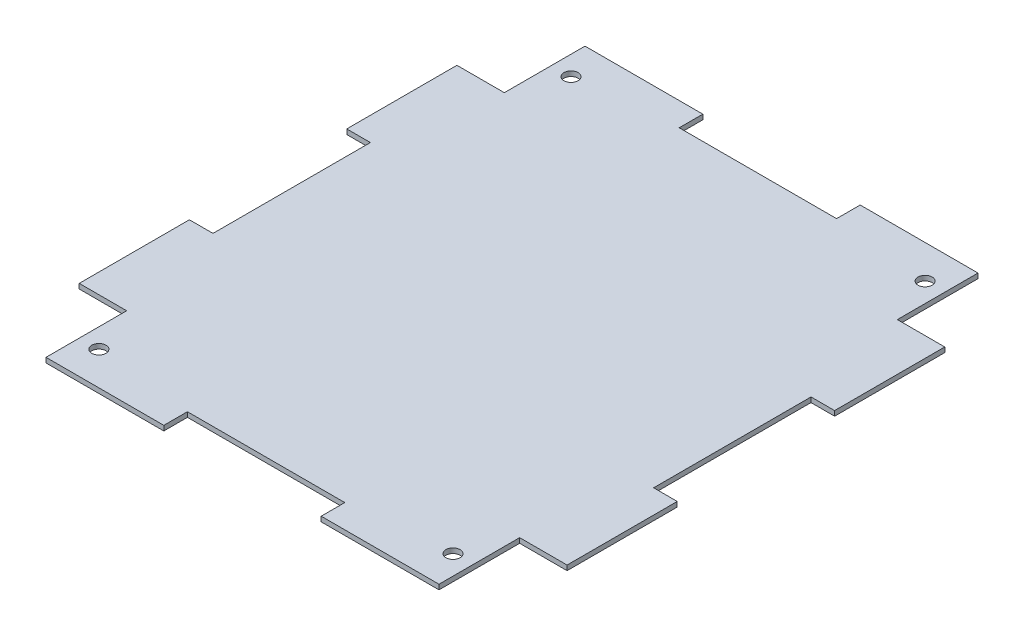
ISO-10303-21;
HEADER;
FILE_DESCRIPTION(('STEP AP214'),'2;1');
FILE_NAME('part.step','',(''),(''),'','','');
FILE_SCHEMA(('AUTOMOTIVE_DESIGN { 1 0 10303 214 1 1 1 1 }'));
ENDSEC;
DATA;
#1=APPLICATION_CONTEXT('core data for automotive mechanical design processes');
#2=APPLICATION_PROTOCOL_DEFINITION('international standard','automotive_design',2000,#1);
#3=PRODUCT_CONTEXT('',#1,'mechanical');
#4=PRODUCT('Part','Part','',(#3));
#5=PRODUCT_RELATED_PRODUCT_CATEGORY('part','',(#4));
#6=PRODUCT_DEFINITION_FORMATION('','',#4);
#7=PRODUCT_DEFINITION_CONTEXT('part definition',#1,'design');
#8=PRODUCT_DEFINITION('design','',#6,#7);
#9=PRODUCT_DEFINITION_SHAPE('','',#8);
#10=(LENGTH_UNIT() NAMED_UNIT(*) SI_UNIT(.MILLI.,.METRE.));
#11=(NAMED_UNIT(*) PLANE_ANGLE_UNIT() SI_UNIT($,.RADIAN.));
#12=(NAMED_UNIT(*) SI_UNIT($,.STERADIAN.) SOLID_ANGLE_UNIT());
#13=UNCERTAINTY_MEASURE_WITH_UNIT(LENGTH_MEASURE(1.E-05),#10,'distance_accuracy_value','');
#14=(GEOMETRIC_REPRESENTATION_CONTEXT(3) GLOBAL_UNCERTAINTY_ASSIGNED_CONTEXT((#13)) GLOBAL_UNIT_ASSIGNED_CONTEXT((#10,
#11,#12)) REPRESENTATION_CONTEXT('',''));
#15=CARTESIAN_POINT('',(0.,0.,0.));
#16=DIRECTION('',(0.,0.,1.));
#17=DIRECTION('',(1.,0.,0.));
#18=AXIS2_PLACEMENT_3D('',#15,#16,#17);
#19=CARTESIAN_POINT('',(0.,1.5875,0.));
#20=DIRECTION('',(0.,1.,0.));
#21=DIRECTION('',(0.,0.,1.));
#22=AXIS2_PLACEMENT_3D('',#19,#20,#21);
#23=PLANE('',#22);
#24=CARTESIAN_POINT('',(57.15,1.5875,76.2));
#25=DIRECTION('',(0.,1.,0.));
#26=DIRECTION('',(0.,0.,1.));
#27=AXIS2_PLACEMENT_3D('',#24,#25,#26);
#28=CIRCLE('',#27,2.28599999999999);
#29=CARTESIAN_POINT('',(57.15,1.5875,78.486));
#30=VERTEX_POINT('',#29);
#31=EDGE_CURVE('E588',#30,#30,#28,.T.);
#32=ORIENTED_EDGE('',*,*,#31,.F.);
#33=EDGE_LOOP('',(#32));
#34=FACE_BOUND('',#33,.T.);
#35=CARTESIAN_POINT('',(-57.15,1.5875,-76.2));
#36=DIRECTION('',(0.,1.,0.));
#37=DIRECTION('',(0.,0.,1.));
#38=AXIS2_PLACEMENT_3D('',#35,#36,#37);
#39=CIRCLE('',#38,2.28599999999999);
#40=CARTESIAN_POINT('',(-57.15,1.5875,-73.914));
#41=VERTEX_POINT('',#40);
#42=EDGE_CURVE('E266',#41,#41,#39,.T.);
#43=ORIENTED_EDGE('',*,*,#42,.F.);
#44=EDGE_LOOP('',(#43));
#45=FACE_BOUND('',#44,.T.);
#46=DIRECTION('',(0.,0.,1.));
#47=VECTOR('',#46,1.);
#48=CARTESIAN_POINT('',(-78.7400000000001,1.5875,25.4));
#49=LINE('',#48,#47);
#50=CARTESIAN_POINT('',(-78.7400000000001,1.5875,25.4));
#51=VERTEX_POINT('',#50);
#52=CARTESIAN_POINT('',(-78.74,1.5875,60.96));
#53=VERTEX_POINT('',#52);
#54=EDGE_CURVE('E344',#51,#53,#49,.T.);
#55=ORIENTED_EDGE('',*,*,#54,.T.);
#56=DIRECTION('',(1.,0.,0.));
#57=VECTOR('',#56,1.);
#58=CARTESIAN_POINT('',(-78.74,1.5875,60.96));
#59=LINE('',#58,#57);
#60=CARTESIAN_POINT('',(-63.43142,1.5875,60.96));
#61=VERTEX_POINT('',#60);
#62=EDGE_CURVE('E160',#53,#61,#59,.T.);
#63=ORIENTED_EDGE('',*,*,#62,.T.);
#64=DIRECTION('',(0.,0.,1.));
#65=VECTOR('',#64,1.);
#66=CARTESIAN_POINT('',(-63.43142,1.5875,60.96));
#67=LINE('',#66,#65);
#68=CARTESIAN_POINT('',(-63.43142,1.5875,86.995));
#69=VERTEX_POINT('',#68);
#70=EDGE_CURVE('E445',#61,#69,#67,.T.);
#71=ORIENTED_EDGE('',*,*,#70,.T.);
#72=DIRECTION('',(1.,0.,0.));
#73=VECTOR('',#72,1.);
#74=CARTESIAN_POINT('',(-63.43142,1.5875,86.995));
#75=LINE('',#74,#73);
#76=CARTESIAN_POINT('',(-25.4,1.5875,86.995));
#77=VERTEX_POINT('',#76);
#78=EDGE_CURVE('E465',#69,#77,#75,.T.);
#79=ORIENTED_EDGE('',*,*,#78,.T.);
#80=DIRECTION('',(0.,0.,-1.));
#81=VECTOR('',#80,1.);
#82=CARTESIAN_POINT('',(-25.4,1.5875,86.995));
#83=LINE('',#82,#81);
#84=CARTESIAN_POINT('',(-25.4,1.5875,79.375));
#85=VERTEX_POINT('',#84);
#86=EDGE_CURVE('E461',#77,#85,#83,.T.);
#87=ORIENTED_EDGE('',*,*,#86,.T.);
#88=DIRECTION('',(1.,0.,0.));
#89=VECTOR('',#88,1.);
#90=CARTESIAN_POINT('',(25.4,1.5875,79.375));
#91=LINE('',#90,#89);
#92=CARTESIAN_POINT('',(25.4,1.5875,79.375));
#93=VERTEX_POINT('',#92);
#94=EDGE_CURVE('E464',#85,#93,#91,.T.);
#95=ORIENTED_EDGE('',*,*,#94,.T.);
#96=DIRECTION('',(0.,0.,1.));
#97=VECTOR('',#96,1.);
#98=CARTESIAN_POINT('',(25.4,1.5875,86.995));
#99=LINE('',#98,#97);
#100=CARTESIAN_POINT('',(25.4,1.5875,86.995));
#101=VERTEX_POINT('',#100);
#102=EDGE_CURVE('E469',#93,#101,#99,.T.);
#103=ORIENTED_EDGE('',*,*,#102,.T.);
#104=DIRECTION('',(1.,0.,0.));
#105=VECTOR('',#104,1.);
#106=CARTESIAN_POINT('',(25.4,1.5875,86.995));
#107=LINE('',#106,#105);
#108=CARTESIAN_POINT('',(63.43142,1.5875,86.995));
#109=VERTEX_POINT('',#108);
#110=EDGE_CURVE('E476',#101,#109,#107,.T.);
#111=ORIENTED_EDGE('',*,*,#110,.T.);
#112=DIRECTION('',(0.,0.,-1.));
#113=VECTOR('',#112,1.);
#114=CARTESIAN_POINT('',(63.43142,1.5875,86.995));
#115=LINE('',#114,#113);
#116=CARTESIAN_POINT('',(63.43142,1.5875,60.96));
#117=VERTEX_POINT('',#116);
#118=EDGE_CURVE('E479',#109,#117,#115,.T.);
#119=ORIENTED_EDGE('',*,*,#118,.T.);
#120=DIRECTION('',(1.,0.,0.));
#121=VECTOR('',#120,1.);
#122=CARTESIAN_POINT('',(63.43142,1.5875,60.96));
#123=LINE('',#122,#121);
#124=CARTESIAN_POINT('',(78.74,1.5875,60.96));
#125=VERTEX_POINT('',#124);
#126=EDGE_CURVE('E482',#117,#125,#123,.T.);
#127=ORIENTED_EDGE('',*,*,#126,.T.);
#128=DIRECTION('',(0.,0.,-1.));
#129=VECTOR('',#128,1.);
#130=CARTESIAN_POINT('',(78.74,1.5875,60.96));
#131=LINE('',#130,#129);
#132=CARTESIAN_POINT('',(78.74,1.5875,25.4));
#133=VERTEX_POINT('',#132);
#134=EDGE_CURVE('E485',#125,#133,#131,.T.);
#135=ORIENTED_EDGE('',*,*,#134,.T.);
#136=DIRECTION('',(-1.,0.,0.));
#137=VECTOR('',#136,1.);
#138=CARTESIAN_POINT('',(78.74,1.5875,25.4));
#139=LINE('',#138,#137);
#140=CARTESIAN_POINT('',(71.12,1.5875,25.4));
#141=VERTEX_POINT('',#140);
#142=EDGE_CURVE('E488',#133,#141,#139,.T.);
#143=ORIENTED_EDGE('',*,*,#142,.T.);
#144=DIRECTION('',(0.,0.,-1.));
#145=VECTOR('',#144,1.);
#146=CARTESIAN_POINT('',(71.12,1.5875,-25.4));
#147=LINE('',#146,#145);
#148=CARTESIAN_POINT('',(71.12,1.5875,-25.4));
#149=VERTEX_POINT('',#148);
#150=EDGE_CURVE('E491',#141,#149,#147,.T.);
#151=ORIENTED_EDGE('',*,*,#150,.T.);
#152=DIRECTION('',(1.,0.,0.));
#153=VECTOR('',#152,1.);
#154=CARTESIAN_POINT('',(78.74,1.5875,-25.4));
#155=LINE('',#154,#153);
#156=CARTESIAN_POINT('',(78.74,1.5875,-25.4));
#157=VERTEX_POINT('',#156);
#158=EDGE_CURVE('E494',#149,#157,#155,.T.);
#159=ORIENTED_EDGE('',*,*,#158,.T.);
#160=DIRECTION('',(0.,0.,-1.));
#161=VECTOR('',#160,1.);
#162=CARTESIAN_POINT('',(78.74,1.5875,-25.4));
#163=LINE('',#162,#161);
#164=CARTESIAN_POINT('',(78.74,1.5875,-60.96));
#165=VERTEX_POINT('',#164);
#166=EDGE_CURVE('E497',#157,#165,#163,.T.);
#167=ORIENTED_EDGE('',*,*,#166,.T.);
#168=DIRECTION('',(-1.,0.,0.));
#169=VECTOR('',#168,1.);
#170=CARTESIAN_POINT('',(78.74,1.5875,-60.96));
#171=LINE('',#170,#169);
#172=CARTESIAN_POINT('',(63.43142,1.5875,-60.96));
#173=VERTEX_POINT('',#172);
#174=EDGE_CURVE('E500',#165,#173,#171,.T.);
#175=ORIENTED_EDGE('',*,*,#174,.T.);
#176=DIRECTION('',(0.,0.,-1.));
#177=VECTOR('',#176,1.);
#178=CARTESIAN_POINT('',(63.43142,1.5875,-60.96));
#179=LINE('',#178,#177);
#180=CARTESIAN_POINT('',(63.43142,1.5875,-86.995));
#181=VERTEX_POINT('',#180);
#182=EDGE_CURVE('E503',#173,#181,#179,.T.);
#183=ORIENTED_EDGE('',*,*,#182,.T.);
#184=DIRECTION('',(-1.,0.,0.));
#185=VECTOR('',#184,1.);
#186=CARTESIAN_POINT('',(63.43142,1.5875,-86.995));
#187=LINE('',#186,#185);
#188=CARTESIAN_POINT('',(25.4,1.5875,-86.995));
#189=VERTEX_POINT('',#188);
#190=EDGE_CURVE('E506',#181,#189,#187,.T.);
#191=ORIENTED_EDGE('',*,*,#190,.T.);
#192=DIRECTION('',(0.,0.,1.));
#193=VECTOR('',#192,1.);
#194=CARTESIAN_POINT('',(25.4,1.5875,-86.995));
#195=LINE('',#194,#193);
#196=CARTESIAN_POINT('',(25.4,1.5875,-79.375));
#197=VERTEX_POINT('',#196);
#198=EDGE_CURVE('E509',#189,#197,#195,.T.);
#199=ORIENTED_EDGE('',*,*,#198,.T.);
#200=DIRECTION('',(-1.,0.,0.));
#201=VECTOR('',#200,1.);
#202=CARTESIAN_POINT('',(-25.4,1.5875,-79.375));
#203=LINE('',#202,#201);
#204=CARTESIAN_POINT('',(-25.4,1.5875,-79.375));
#205=VERTEX_POINT('',#204);
#206=EDGE_CURVE('E512',#197,#205,#203,.T.);
#207=ORIENTED_EDGE('',*,*,#206,.T.);
#208=DIRECTION('',(0.,0.,-1.));
#209=VECTOR('',#208,1.);
#210=CARTESIAN_POINT('',(-25.4,1.5875,-86.995));
#211=LINE('',#210,#209);
#212=CARTESIAN_POINT('',(-25.4,1.5875,-86.995));
#213=VERTEX_POINT('',#212);
#214=EDGE_CURVE('E515',#205,#213,#211,.T.);
#215=ORIENTED_EDGE('',*,*,#214,.T.);
#216=DIRECTION('',(-1.,0.,0.));
#217=VECTOR('',#216,1.);
#218=CARTESIAN_POINT('',(-25.4,1.5875,-86.995));
#219=LINE('',#218,#217);
#220=CARTESIAN_POINT('',(-63.43142,1.5875,-86.995));
#221=VERTEX_POINT('',#220);
#222=EDGE_CURVE('E518',#213,#221,#219,.T.);
#223=ORIENTED_EDGE('',*,*,#222,.T.);
#224=DIRECTION('',(0.,0.,1.));
#225=VECTOR('',#224,1.);
#226=CARTESIAN_POINT('',(-63.43142,1.5875,-86.995));
#227=LINE('',#226,#225);
#228=CARTESIAN_POINT('',(-63.43142,1.5875,-60.96));
#229=VERTEX_POINT('',#228);
#230=EDGE_CURVE('E521',#221,#229,#227,.T.);
#231=ORIENTED_EDGE('',*,*,#230,.T.);
#232=DIRECTION('',(-1.,0.,0.));
#233=VECTOR('',#232,1.);
#234=CARTESIAN_POINT('',(-63.43142,1.5875,-60.96));
#235=LINE('',#234,#233);
#236=CARTESIAN_POINT('',(-78.74,1.5875,-60.96));
#237=VERTEX_POINT('',#236);
#238=EDGE_CURVE('E524',#229,#237,#235,.T.);
#239=ORIENTED_EDGE('',*,*,#238,.T.);
#240=DIRECTION('',(0.,0.,1.));
#241=VECTOR('',#240,1.);
#242=CARTESIAN_POINT('',(-78.74,1.5875,-60.96));
#243=LINE('',#242,#241);
#244=CARTESIAN_POINT('',(-78.7400000000001,1.5875,-25.4));
#245=VERTEX_POINT('',#244);
#246=EDGE_CURVE('E239',#237,#245,#243,.T.);
#247=ORIENTED_EDGE('',*,*,#246,.T.);
#248=DIRECTION('',(1.,0.,0.));
#249=VECTOR('',#248,1.);
#250=CARTESIAN_POINT('',(-78.7400000000001,1.5875,-25.4));
#251=LINE('',#250,#249);
#252=CARTESIAN_POINT('',(-71.12,1.5875,-25.4));
#253=VERTEX_POINT('',#252);
#254=EDGE_CURVE('E233',#245,#253,#251,.T.);
#255=ORIENTED_EDGE('',*,*,#254,.T.);
#256=DIRECTION('',(0.,0.,1.));
#257=VECTOR('',#256,1.);
#258=CARTESIAN_POINT('',(-71.12,1.5875,25.4));
#259=LINE('',#258,#257);
#260=CARTESIAN_POINT('',(-71.12,1.5875,25.4));
#261=VERTEX_POINT('',#260);
#262=EDGE_CURVE('E237',#253,#261,#259,.T.);
#263=ORIENTED_EDGE('',*,*,#262,.T.);
#264=DIRECTION('',(-1.,0.,0.));
#265=VECTOR('',#264,1.);
#266=CARTESIAN_POINT('',(-78.7400000000001,1.5875,25.4));
#267=LINE('',#266,#265);
#268=EDGE_CURVE('E57',#261,#51,#267,.T.);
#269=ORIENTED_EDGE('',*,*,#268,.T.);
#270=EDGE_LOOP('',(#55,#63,#71,#79,#87,#95,#103,#111,#119,#127,#135,#143,#151,#159,#167,#175,
#183,#191,#199,#207,#215,#223,#231,#239,#247,#255,#263,#269));
#271=FACE_BOUND('',#270,.T.);
#272=CARTESIAN_POINT('',(57.15,1.5875,-76.2));
#273=DIRECTION('',(0.,1.,0.));
#274=DIRECTION('',(0.,0.,1.));
#275=AXIS2_PLACEMENT_3D('',#272,#273,#274);
#276=CIRCLE('',#275,2.28599999999999);
#277=CARTESIAN_POINT('',(57.15,1.5875,-73.914));
#278=VERTEX_POINT('',#277);
#279=EDGE_CURVE('E596',#278,#278,#276,.T.);
#280=ORIENTED_EDGE('',*,*,#279,.F.);
#281=EDGE_LOOP('',(#280));
#282=FACE_BOUND('',#281,.T.);
#283=CARTESIAN_POINT('',(-57.1500000000003,1.5875,76.2));
#284=DIRECTION('',(0.,1.,0.));
#285=DIRECTION('',(0.,0.,1.));
#286=AXIS2_PLACEMENT_3D('',#283,#284,#285);
#287=CIRCLE('',#286,2.2860000000002);
#288=CARTESIAN_POINT('',(-57.1500000000003,1.5875,78.4860000000002));
#289=VERTEX_POINT('',#288);
#290=EDGE_CURVE('E577',#289,#289,#287,.T.);
#291=ORIENTED_EDGE('',*,*,#290,.F.);
#292=EDGE_LOOP('',(#291));
#293=FACE_BOUND('',#292,.T.);
#294=ADVANCED_FACE('F39',(#34,#45,#271,#282,#293),#23,.T.);
#295=CARTESIAN_POINT('',(0.,0.,0.));
#296=DIRECTION('',(0.,1.,0.));
#297=DIRECTION('',(0.,0.,1.));
#298=AXIS2_PLACEMENT_3D('',#295,#296,#297);
#299=PLANE('',#298);
#300=DIRECTION('',(0.,0.,1.));
#301=VECTOR('',#300,1.);
#302=CARTESIAN_POINT('',(-78.7400000000001,0.,25.4));
#303=LINE('',#302,#301);
#304=CARTESIAN_POINT('',(-78.7400000000001,0.,25.4));
#305=VERTEX_POINT('',#304);
#306=CARTESIAN_POINT('',(-78.74,0.,60.96));
#307=VERTEX_POINT('',#306);
#308=EDGE_CURVE('E261',#305,#307,#303,.T.);
#309=ORIENTED_EDGE('',*,*,#308,.F.);
#310=DIRECTION('',(-1.,0.,0.));
#311=VECTOR('',#310,1.);
#312=CARTESIAN_POINT('',(-78.7400000000001,0.,25.4));
#313=LINE('',#312,#311);
#314=CARTESIAN_POINT('',(-71.12,0.,25.4));
#315=VERTEX_POINT('',#314);
#316=EDGE_CURVE('E152',#315,#305,#313,.T.);
#317=ORIENTED_EDGE('',*,*,#316,.F.);
#318=DIRECTION('',(0.,0.,1.));
#319=VECTOR('',#318,1.);
#320=CARTESIAN_POINT('',(-71.12,0.,25.4));
#321=LINE('',#320,#319);
#322=CARTESIAN_POINT('',(-71.12,0.,-25.4));
#323=VERTEX_POINT('',#322);
#324=EDGE_CURVE('E146',#323,#315,#321,.T.);
#325=ORIENTED_EDGE('',*,*,#324,.F.);
#326=DIRECTION('',(1.,0.,0.));
#327=VECTOR('',#326,1.);
#328=CARTESIAN_POINT('',(-78.7400000000001,0.,-25.4));
#329=LINE('',#328,#327);
#330=CARTESIAN_POINT('',(-78.7400000000001,0.,-25.4));
#331=VERTEX_POINT('',#330);
#332=EDGE_CURVE('E248',#331,#323,#329,.T.);
#333=ORIENTED_EDGE('',*,*,#332,.F.);
#334=DIRECTION('',(0.,0.,1.));
#335=VECTOR('',#334,1.);
#336=CARTESIAN_POINT('',(-78.74,0.,-60.96));
#337=LINE('',#336,#335);
#338=CARTESIAN_POINT('',(-78.74,0.,-60.96));
#339=VERTEX_POINT('',#338);
#340=EDGE_CURVE('E335',#339,#331,#337,.T.);
#341=ORIENTED_EDGE('',*,*,#340,.F.);
#342=DIRECTION('',(-1.,0.,0.));
#343=VECTOR('',#342,1.);
#344=CARTESIAN_POINT('',(-63.43142,0.,-60.96));
#345=LINE('',#344,#343);
#346=CARTESIAN_POINT('',(-63.43142,0.,-60.96));
#347=VERTEX_POINT('',#346);
#348=EDGE_CURVE('E332',#347,#339,#345,.T.);
#349=ORIENTED_EDGE('',*,*,#348,.F.);
#350=DIRECTION('',(0.,0.,1.));
#351=VECTOR('',#350,1.);
#352=CARTESIAN_POINT('',(-63.43142,0.,-86.995));
#353=LINE('',#352,#351);
#354=CARTESIAN_POINT('',(-63.43142,0.,-86.995));
#355=VERTEX_POINT('',#354);
#356=EDGE_CURVE('E329',#355,#347,#353,.T.);
#357=ORIENTED_EDGE('',*,*,#356,.F.);
#358=DIRECTION('',(-1.,0.,0.));
#359=VECTOR('',#358,1.);
#360=CARTESIAN_POINT('',(-25.4,0.,-86.995));
#361=LINE('',#360,#359);
#362=CARTESIAN_POINT('',(-25.4,0.,-86.995));
#363=VERTEX_POINT('',#362);
#364=EDGE_CURVE('E326',#363,#355,#361,.T.);
#365=ORIENTED_EDGE('',*,*,#364,.F.);
#366=DIRECTION('',(0.,0.,-1.));
#367=VECTOR('',#366,1.);
#368=CARTESIAN_POINT('',(-25.4,0.,-86.995));
#369=LINE('',#368,#367);
#370=CARTESIAN_POINT('',(-25.4,0.,-79.375));
#371=VERTEX_POINT('',#370);
#372=EDGE_CURVE('E323',#371,#363,#369,.T.);
#373=ORIENTED_EDGE('',*,*,#372,.F.);
#374=DIRECTION('',(-1.,0.,0.));
#375=VECTOR('',#374,1.);
#376=CARTESIAN_POINT('',(-25.4,0.,-79.375));
#377=LINE('',#376,#375);
#378=CARTESIAN_POINT('',(25.4,0.,-79.375));
#379=VERTEX_POINT('',#378);
#380=EDGE_CURVE('E320',#379,#371,#377,.T.);
#381=ORIENTED_EDGE('',*,*,#380,.F.);
#382=DIRECTION('',(0.,0.,1.));
#383=VECTOR('',#382,1.);
#384=CARTESIAN_POINT('',(25.4,0.,-86.995));
#385=LINE('',#384,#383);
#386=CARTESIAN_POINT('',(25.4,0.,-86.995));
#387=VERTEX_POINT('',#386);
#388=EDGE_CURVE('E317',#387,#379,#385,.T.);
#389=ORIENTED_EDGE('',*,*,#388,.F.);
#390=DIRECTION('',(-1.,0.,0.));
#391=VECTOR('',#390,1.);
#392=CARTESIAN_POINT('',(63.43142,0.,-86.995));
#393=LINE('',#392,#391);
#394=CARTESIAN_POINT('',(63.43142,0.,-86.995));
#395=VERTEX_POINT('',#394);
#396=EDGE_CURVE('E314',#395,#387,#393,.T.);
#397=ORIENTED_EDGE('',*,*,#396,.F.);
#398=DIRECTION('',(0.,0.,-1.));
#399=VECTOR('',#398,1.);
#400=CARTESIAN_POINT('',(63.43142,0.,-60.96));
#401=LINE('',#400,#399);
#402=CARTESIAN_POINT('',(63.43142,0.,-60.96));
#403=VERTEX_POINT('',#402);
#404=EDGE_CURVE('E311',#403,#395,#401,.T.);
#405=ORIENTED_EDGE('',*,*,#404,.F.);
#406=DIRECTION('',(-1.,0.,0.));
#407=VECTOR('',#406,1.);
#408=CARTESIAN_POINT('',(78.74,0.,-60.96));
#409=LINE('',#408,#407);
#410=CARTESIAN_POINT('',(78.74,0.,-60.96));
#411=VERTEX_POINT('',#410);
#412=EDGE_CURVE('E308',#411,#403,#409,.T.);
#413=ORIENTED_EDGE('',*,*,#412,.F.);
#414=DIRECTION('',(0.,0.,-1.));
#415=VECTOR('',#414,1.);
#416=CARTESIAN_POINT('',(78.74,0.,-25.4));
#417=LINE('',#416,#415);
#418=CARTESIAN_POINT('',(78.74,0.,-25.4));
#419=VERTEX_POINT('',#418);
#420=EDGE_CURVE('E305',#419,#411,#417,.T.);
#421=ORIENTED_EDGE('',*,*,#420,.F.);
#422=DIRECTION('',(1.,0.,0.));
#423=VECTOR('',#422,1.);
#424=CARTESIAN_POINT('',(78.74,0.,-25.4));
#425=LINE('',#424,#423);
#426=CARTESIAN_POINT('',(71.12,0.,-25.4));
#427=VERTEX_POINT('',#426);
#428=EDGE_CURVE('E302',#427,#419,#425,.T.);
#429=ORIENTED_EDGE('',*,*,#428,.F.);
#430=DIRECTION('',(0.,0.,-1.));
#431=VECTOR('',#430,1.);
#432=CARTESIAN_POINT('',(71.12,0.,-25.4));
#433=LINE('',#432,#431);
#434=CARTESIAN_POINT('',(71.12,0.,25.4));
#435=VERTEX_POINT('',#434);
#436=EDGE_CURVE('E299',#435,#427,#433,.T.);
#437=ORIENTED_EDGE('',*,*,#436,.F.);
#438=DIRECTION('',(-1.,0.,0.));
#439=VECTOR('',#438,1.);
#440=CARTESIAN_POINT('',(78.74,0.,25.4));
#441=LINE('',#440,#439);
#442=CARTESIAN_POINT('',(78.74,0.,25.4));
#443=VERTEX_POINT('',#442);
#444=EDGE_CURVE('E296',#443,#435,#441,.T.);
#445=ORIENTED_EDGE('',*,*,#444,.F.);
#446=DIRECTION('',(0.,0.,-1.));
#447=VECTOR('',#446,1.);
#448=CARTESIAN_POINT('',(78.74,0.,60.96));
#449=LINE('',#448,#447);
#450=CARTESIAN_POINT('',(78.74,0.,60.96));
#451=VERTEX_POINT('',#450);
#452=EDGE_CURVE('E293',#451,#443,#449,.T.);
#453=ORIENTED_EDGE('',*,*,#452,.F.);
#454=DIRECTION('',(1.,0.,0.));
#455=VECTOR('',#454,1.);
#456=CARTESIAN_POINT('',(63.43142,0.,60.96));
#457=LINE('',#456,#455);
#458=CARTESIAN_POINT('',(63.43142,0.,60.96));
#459=VERTEX_POINT('',#458);
#460=EDGE_CURVE('E290',#459,#451,#457,.T.);
#461=ORIENTED_EDGE('',*,*,#460,.F.);
#462=DIRECTION('',(0.,0.,-1.));
#463=VECTOR('',#462,1.);
#464=CARTESIAN_POINT('',(63.43142,0.,86.995));
#465=LINE('',#464,#463);
#466=CARTESIAN_POINT('',(63.43142,0.,86.995));
#467=VERTEX_POINT('',#466);
#468=EDGE_CURVE('E287',#467,#459,#465,.T.);
#469=ORIENTED_EDGE('',*,*,#468,.F.);
#470=DIRECTION('',(1.,0.,0.));
#471=VECTOR('',#470,1.);
#472=CARTESIAN_POINT('',(25.4,0.,86.995));
#473=LINE('',#472,#471);
#474=CARTESIAN_POINT('',(25.4,0.,86.995));
#475=VERTEX_POINT('',#474);
#476=EDGE_CURVE('E284',#475,#467,#473,.T.);
#477=ORIENTED_EDGE('',*,*,#476,.F.);
#478=DIRECTION('',(0.,0.,1.));
#479=VECTOR('',#478,1.);
#480=CARTESIAN_POINT('',(25.4,0.,86.995));
#481=LINE('',#480,#479);
#482=CARTESIAN_POINT('',(25.4,0.,79.375));
#483=VERTEX_POINT('',#482);
#484=EDGE_CURVE('E281',#483,#475,#481,.T.);
#485=ORIENTED_EDGE('',*,*,#484,.F.);
#486=DIRECTION('',(1.,0.,0.));
#487=VECTOR('',#486,1.);
#488=CARTESIAN_POINT('',(25.4,0.,79.375));
#489=LINE('',#488,#487);
#490=CARTESIAN_POINT('',(-25.4,0.,79.375));
#491=VERTEX_POINT('',#490);
#492=EDGE_CURVE('E278',#491,#483,#489,.T.);
#493=ORIENTED_EDGE('',*,*,#492,.F.);
#494=DIRECTION('',(0.,0.,-1.));
#495=VECTOR('',#494,1.);
#496=CARTESIAN_POINT('',(-25.4,0.,86.995));
#497=LINE('',#496,#495);
#498=CARTESIAN_POINT('',(-25.4,0.,86.995));
#499=VERTEX_POINT('',#498);
#500=EDGE_CURVE('E275',#499,#491,#497,.T.);
#501=ORIENTED_EDGE('',*,*,#500,.F.);
#502=DIRECTION('',(1.,0.,0.));
#503=VECTOR('',#502,1.);
#504=CARTESIAN_POINT('',(-63.43142,0.,86.995));
#505=LINE('',#504,#503);
#506=CARTESIAN_POINT('',(-63.43142,0.,86.995));
#507=VERTEX_POINT('',#506);
#508=EDGE_CURVE('E272',#507,#499,#505,.T.);
#509=ORIENTED_EDGE('',*,*,#508,.F.);
#510=DIRECTION('',(0.,0.,1.));
#511=VECTOR('',#510,1.);
#512=CARTESIAN_POINT('',(-63.43142,0.,60.96));
#513=LINE('',#512,#511);
#514=CARTESIAN_POINT('',(-63.43142,0.,60.96));
#515=VERTEX_POINT('',#514);
#516=EDGE_CURVE('E269',#515,#507,#513,.T.);
#517=ORIENTED_EDGE('',*,*,#516,.F.);
#518=DIRECTION('',(1.,0.,0.));
#519=VECTOR('',#518,1.);
#520=CARTESIAN_POINT('',(-78.74,0.,60.96));
#521=LINE('',#520,#519);
#522=EDGE_CURVE('E265',#307,#515,#521,.T.);
#523=ORIENTED_EDGE('',*,*,#522,.F.);
#524=EDGE_LOOP('',(#309,#317,#325,#333,#341,#349,#357,#365,#373,#381,#389,#397,#405,#413,#421,
#429,#437,#445,#453,#461,#469,#477,#485,#493,#501,#509,#517,#523));
#525=FACE_BOUND('',#524,.T.);
#526=CARTESIAN_POINT('',(-57.15,0.,-76.2));
#527=DIRECTION('',(0.,1.,0.));
#528=DIRECTION('',(0.,0.,1.));
#529=AXIS2_PLACEMENT_3D('',#526,#527,#528);
#530=CIRCLE('',#529,2.28599999999999);
#531=CARTESIAN_POINT('',(-57.15,0.,-73.914));
#532=VERTEX_POINT('',#531);
#533=EDGE_CURVE('E600',#532,#532,#530,.T.);
#534=ORIENTED_EDGE('',*,*,#533,.T.);
#535=EDGE_LOOP('',(#534));
#536=FACE_BOUND('',#535,.T.);
#537=CARTESIAN_POINT('',(57.15,0.,-76.2));
#538=DIRECTION('',(0.,1.,0.));
#539=DIRECTION('',(0.,0.,1.));
#540=AXIS2_PLACEMENT_3D('',#537,#538,#539);
#541=CIRCLE('',#540,2.28599999999999);
#542=CARTESIAN_POINT('',(57.15,0.,-73.914));
#543=VERTEX_POINT('',#542);
#544=EDGE_CURVE('E592',#543,#543,#541,.T.);
#545=ORIENTED_EDGE('',*,*,#544,.T.);
#546=EDGE_LOOP('',(#545));
#547=FACE_BOUND('',#546,.T.);
#548=CARTESIAN_POINT('',(57.15,0.,76.2));
#549=DIRECTION('',(0.,1.,0.));
#550=DIRECTION('',(0.,0.,1.));
#551=AXIS2_PLACEMENT_3D('',#548,#549,#550);
#552=CIRCLE('',#551,2.28599999999999);
#553=CARTESIAN_POINT('',(57.15,0.,78.486));
#554=VERTEX_POINT('',#553);
#555=EDGE_CURVE('E585',#554,#554,#552,.T.);
#556=ORIENTED_EDGE('',*,*,#555,.T.);
#557=EDGE_LOOP('',(#556));
#558=FACE_BOUND('',#557,.T.);
#559=CARTESIAN_POINT('',(-57.1500000000003,0.,76.2));
#560=DIRECTION('',(0.,1.,0.));
#561=DIRECTION('',(0.,0.,1.));
#562=AXIS2_PLACEMENT_3D('',#559,#560,#561);
#563=CIRCLE('',#562,2.2860000000002);
#564=CARTESIAN_POINT('',(-57.1500000000003,0.,78.4860000000002));
#565=VERTEX_POINT('',#564);
#566=EDGE_CURVE('E580',#565,#565,#563,.T.);
#567=ORIENTED_EDGE('',*,*,#566,.T.);
#568=EDGE_LOOP('',(#567));
#569=FACE_BOUND('',#568,.T.);
#570=ADVANCED_FACE('F449',(#525,#536,#547,#558,#569),#299,.F.);
#571=CARTESIAN_POINT('',(-78.7400000000001,1.5875,25.4));
#572=DIRECTION('',(1.,0.,0.));
#573=DIRECTION('',(0.,0.,-1.));
#574=AXIS2_PLACEMENT_3D('',#571,#572,#573);
#575=PLANE('',#574);
#576=ORIENTED_EDGE('',*,*,#308,.T.);
#577=DIRECTION('',(0.,-1.,0.));
#578=VECTOR('',#577,1.);
#579=CARTESIAN_POINT('',(-78.74,1.5875,60.96));
#580=LINE('',#579,#578);
#581=EDGE_CURVE('E11',#53,#307,#580,.T.);
#582=ORIENTED_EDGE('',*,*,#581,.F.);
#583=ORIENTED_EDGE('',*,*,#54,.F.);
#584=DIRECTION('',(0.,-1.,0.));
#585=VECTOR('',#584,1.);
#586=CARTESIAN_POINT('',(-78.7400000000001,1.5875,25.4));
#587=LINE('',#586,#585);
#588=EDGE_CURVE('E257',#51,#305,#587,.T.);
#589=ORIENTED_EDGE('',*,*,#588,.T.);
#590=EDGE_LOOP('',(#576,#582,#583,#589));
#591=FACE_BOUND('',#590,.T.);
#592=ADVANCED_FACE('F41',(#591),#575,.F.);
#593=CARTESIAN_POINT('',(-78.74,1.5875,60.96));
#594=DIRECTION('',(0.,0.,-1.));
#595=DIRECTION('',(-1.,0.,0.));
#596=AXIS2_PLACEMENT_3D('',#593,#594,#595);
#597=PLANE('',#596);
#598=ORIENTED_EDGE('',*,*,#522,.T.);
#599=DIRECTION('',(0.,-1.,0.));
#600=VECTOR('',#599,1.);
#601=CARTESIAN_POINT('',(-63.43142,1.5875,60.96));
#602=LINE('',#601,#600);
#603=EDGE_CURVE('E49',#61,#515,#602,.T.);
#604=ORIENTED_EDGE('',*,*,#603,.F.);
#605=ORIENTED_EDGE('',*,*,#62,.F.);
#606=ORIENTED_EDGE('',*,*,#581,.T.);
#607=EDGE_LOOP('',(#598,#604,#605,#606));
#608=FACE_BOUND('',#607,.T.);
#609=ADVANCED_FACE('F876',(#608),#597,.F.);
#610=CARTESIAN_POINT('',(-63.43142,1.5875,60.96));
#611=DIRECTION('',(1.,0.,0.));
#612=DIRECTION('',(0.,0.,-1.));
#613=AXIS2_PLACEMENT_3D('',#610,#611,#612);
#614=PLANE('',#613);
#615=ORIENTED_EDGE('',*,*,#516,.T.);
#616=DIRECTION('',(0.,-1.,0.));
#617=VECTOR('',#616,1.);
#618=CARTESIAN_POINT('',(-63.43142,1.5875,86.995));
#619=LINE('',#618,#617);
#620=EDGE_CURVE('E435',#69,#507,#619,.T.);
#621=ORIENTED_EDGE('',*,*,#620,.F.);
#622=ORIENTED_EDGE('',*,*,#70,.F.);
#623=ORIENTED_EDGE('',*,*,#603,.T.);
#624=EDGE_LOOP('',(#615,#621,#622,#623));
#625=FACE_BOUND('',#624,.T.);
#626=ADVANCED_FACE('F443',(#625),#614,.F.);
#627=CARTESIAN_POINT('',(-63.43142,1.5875,86.995));
#628=DIRECTION('',(0.,0.,-1.));
#629=DIRECTION('',(-1.,0.,0.));
#630=AXIS2_PLACEMENT_3D('',#627,#628,#629);
#631=PLANE('',#630);
#632=ORIENTED_EDGE('',*,*,#508,.T.);
#633=DIRECTION('',(0.,-1.,0.));
#634=VECTOR('',#633,1.);
#635=CARTESIAN_POINT('',(-25.4,1.5875,86.995));
#636=LINE('',#635,#634);
#637=EDGE_CURVE('E431',#77,#499,#636,.T.);
#638=ORIENTED_EDGE('',*,*,#637,.F.);
#639=ORIENTED_EDGE('',*,*,#78,.F.);
#640=ORIENTED_EDGE('',*,*,#620,.T.);
#641=EDGE_LOOP('',(#632,#638,#639,#640));
#642=FACE_BOUND('',#641,.T.);
#643=ADVANCED_FACE('F455',(#642),#631,.F.);
#644=CARTESIAN_POINT('',(-25.4,1.5875,86.995));
#645=DIRECTION('',(-1.,0.,0.));
#646=DIRECTION('',(0.,0.,1.));
#647=AXIS2_PLACEMENT_3D('',#644,#645,#646);
#648=PLANE('',#647);
#649=ORIENTED_EDGE('',*,*,#500,.T.);
#650=DIRECTION('',(0.,-1.,0.));
#651=VECTOR('',#650,1.);
#652=CARTESIAN_POINT('',(-25.4,1.5875,79.375));
#653=LINE('',#652,#651);
#654=EDGE_CURVE('E427',#85,#491,#653,.T.);
#655=ORIENTED_EDGE('',*,*,#654,.F.);
#656=ORIENTED_EDGE('',*,*,#86,.F.);
#657=ORIENTED_EDGE('',*,*,#637,.T.);
#658=EDGE_LOOP('',(#649,#655,#656,#657));
#659=FACE_BOUND('',#658,.T.);
#660=ADVANCED_FACE('F459',(#659),#648,.F.);
#661=CARTESIAN_POINT('',(25.4,1.5875,79.375));
#662=DIRECTION('',(0.,0.,-1.));
#663=DIRECTION('',(-1.,0.,0.));
#664=AXIS2_PLACEMENT_3D('',#661,#662,#663);
#665=PLANE('',#664);
#666=ORIENTED_EDGE('',*,*,#492,.T.);
#667=DIRECTION('',(0.,-1.,0.));
#668=VECTOR('',#667,1.);
#669=CARTESIAN_POINT('',(25.4,1.5875,79.375));
#670=LINE('',#669,#668);
#671=EDGE_CURVE('E423',#93,#483,#670,.T.);
#672=ORIENTED_EDGE('',*,*,#671,.F.);
#673=ORIENTED_EDGE('',*,*,#94,.F.);
#674=ORIENTED_EDGE('',*,*,#654,.T.);
#675=EDGE_LOOP('',(#666,#672,#673,#674));
#676=FACE_BOUND('',#675,.T.);
#677=ADVANCED_FACE('F841',(#676),#665,.F.);
#678=CARTESIAN_POINT('',(25.4,1.5875,86.995));
#679=DIRECTION('',(1.,0.,0.));
#680=DIRECTION('',(0.,0.,-1.));
#681=AXIS2_PLACEMENT_3D('',#678,#679,#680);
#682=PLANE('',#681);
#683=ORIENTED_EDGE('',*,*,#484,.T.);
#684=DIRECTION('',(0.,-1.,0.));
#685=VECTOR('',#684,1.);
#686=CARTESIAN_POINT('',(25.4,1.5875,86.995));
#687=LINE('',#686,#685);
#688=EDGE_CURVE('E419',#101,#475,#687,.T.);
#689=ORIENTED_EDGE('',*,*,#688,.F.);
#690=ORIENTED_EDGE('',*,*,#102,.F.);
#691=ORIENTED_EDGE('',*,*,#671,.T.);
#692=EDGE_LOOP('',(#683,#689,#690,#691));
#693=FACE_BOUND('',#692,.T.);
#694=ADVANCED_FACE('F831',(#693),#682,.F.);
#695=CARTESIAN_POINT('',(25.4,1.5875,86.995));
#696=DIRECTION('',(0.,0.,-1.));
#697=DIRECTION('',(-1.,0.,0.));
#698=AXIS2_PLACEMENT_3D('',#695,#696,#697);
#699=PLANE('',#698);
#700=ORIENTED_EDGE('',*,*,#476,.T.);
#701=DIRECTION('',(0.,-1.,0.));
#702=VECTOR('',#701,1.);
#703=CARTESIAN_POINT('',(63.43142,1.5875,86.995));
#704=LINE('',#703,#702);
#705=EDGE_CURVE('E415',#109,#467,#704,.T.);
#706=ORIENTED_EDGE('',*,*,#705,.F.);
#707=ORIENTED_EDGE('',*,*,#110,.F.);
#708=ORIENTED_EDGE('',*,*,#688,.T.);
#709=EDGE_LOOP('',(#700,#706,#707,#708));
#710=FACE_BOUND('',#709,.T.);
#711=ADVANCED_FACE('F821',(#710),#699,.F.);
#712=CARTESIAN_POINT('',(63.43142,1.5875,86.995));
#713=DIRECTION('',(-1.,0.,0.));
#714=DIRECTION('',(0.,0.,1.));
#715=AXIS2_PLACEMENT_3D('',#712,#713,#714);
#716=PLANE('',#715);
#717=ORIENTED_EDGE('',*,*,#468,.T.);
#718=DIRECTION('',(0.,-1.,0.));
#719=VECTOR('',#718,1.);
#720=CARTESIAN_POINT('',(63.43142,1.5875,60.96));
#721=LINE('',#720,#719);
#722=EDGE_CURVE('E411',#117,#459,#721,.T.);
#723=ORIENTED_EDGE('',*,*,#722,.F.);
#724=ORIENTED_EDGE('',*,*,#118,.F.);
#725=ORIENTED_EDGE('',*,*,#705,.T.);
#726=EDGE_LOOP('',(#717,#723,#724,#725));
#727=FACE_BOUND('',#726,.T.);
#728=ADVANCED_FACE('F811',(#727),#716,.F.);
#729=CARTESIAN_POINT('',(63.43142,1.5875,60.96));
#730=DIRECTION('',(0.,0.,-1.));
#731=DIRECTION('',(-1.,0.,0.));
#732=AXIS2_PLACEMENT_3D('',#729,#730,#731);
#733=PLANE('',#732);
#734=ORIENTED_EDGE('',*,*,#460,.T.);
#735=DIRECTION('',(0.,-1.,0.));
#736=VECTOR('',#735,1.);
#737=CARTESIAN_POINT('',(78.74,1.5875,60.96));
#738=LINE('',#737,#736);
#739=EDGE_CURVE('E407',#125,#451,#738,.T.);
#740=ORIENTED_EDGE('',*,*,#739,.F.);
#741=ORIENTED_EDGE('',*,*,#126,.F.);
#742=ORIENTED_EDGE('',*,*,#722,.T.);
#743=EDGE_LOOP('',(#734,#740,#741,#742));
#744=FACE_BOUND('',#743,.T.);
#745=ADVANCED_FACE('F801',(#744),#733,.F.);
#746=CARTESIAN_POINT('',(78.74,1.5875,60.96));
#747=DIRECTION('',(-1.,0.,0.));
#748=DIRECTION('',(0.,0.,1.));
#749=AXIS2_PLACEMENT_3D('',#746,#747,#748);
#750=PLANE('',#749);
#751=ORIENTED_EDGE('',*,*,#452,.T.);
#752=DIRECTION('',(0.,-1.,0.));
#753=VECTOR('',#752,1.);
#754=CARTESIAN_POINT('',(78.74,1.5875,25.4));
#755=LINE('',#754,#753);
#756=EDGE_CURVE('E403',#133,#443,#755,.T.);
#757=ORIENTED_EDGE('',*,*,#756,.F.);
#758=ORIENTED_EDGE('',*,*,#134,.F.);
#759=ORIENTED_EDGE('',*,*,#739,.T.);
#760=EDGE_LOOP('',(#751,#757,#758,#759));
#761=FACE_BOUND('',#760,.T.);
#762=ADVANCED_FACE('F791',(#761),#750,.F.);
#763=CARTESIAN_POINT('',(78.74,1.5875,25.4));
#764=DIRECTION('',(0.,0.,1.));
#765=DIRECTION('',(1.,0.,0.));
#766=AXIS2_PLACEMENT_3D('',#763,#764,#765);
#767=PLANE('',#766);
#768=ORIENTED_EDGE('',*,*,#444,.T.);
#769=DIRECTION('',(0.,-1.,0.));
#770=VECTOR('',#769,1.);
#771=CARTESIAN_POINT('',(71.12,1.5875,25.4));
#772=LINE('',#771,#770);
#773=EDGE_CURVE('E399',#141,#435,#772,.T.);
#774=ORIENTED_EDGE('',*,*,#773,.F.);
#775=ORIENTED_EDGE('',*,*,#142,.F.);
#776=ORIENTED_EDGE('',*,*,#756,.T.);
#777=EDGE_LOOP('',(#768,#774,#775,#776));
#778=FACE_BOUND('',#777,.T.);
#779=ADVANCED_FACE('F781',(#778),#767,.F.);
#780=CARTESIAN_POINT('',(71.12,1.5875,-25.4));
#781=DIRECTION('',(-1.,0.,0.));
#782=DIRECTION('',(0.,0.,1.));
#783=AXIS2_PLACEMENT_3D('',#780,#781,#782);
#784=PLANE('',#783);
#785=ORIENTED_EDGE('',*,*,#436,.T.);
#786=DIRECTION('',(0.,-1.,0.));
#787=VECTOR('',#786,1.);
#788=CARTESIAN_POINT('',(71.12,1.5875,-25.4));
#789=LINE('',#788,#787);
#790=EDGE_CURVE('E395',#149,#427,#789,.T.);
#791=ORIENTED_EDGE('',*,*,#790,.F.);
#792=ORIENTED_EDGE('',*,*,#150,.F.);
#793=ORIENTED_EDGE('',*,*,#773,.T.);
#794=EDGE_LOOP('',(#785,#791,#792,#793));
#795=FACE_BOUND('',#794,.T.);
#796=ADVANCED_FACE('F771',(#795),#784,.F.);
#797=CARTESIAN_POINT('',(78.74,1.5875,-25.4));
#798=DIRECTION('',(0.,0.,-1.));
#799=DIRECTION('',(-1.,0.,0.));
#800=AXIS2_PLACEMENT_3D('',#797,#798,#799);
#801=PLANE('',#800);
#802=ORIENTED_EDGE('',*,*,#428,.T.);
#803=DIRECTION('',(0.,-1.,0.));
#804=VECTOR('',#803,1.);
#805=CARTESIAN_POINT('',(78.74,1.5875,-25.4));
#806=LINE('',#805,#804);
#807=EDGE_CURVE('E391',#157,#419,#806,.T.);
#808=ORIENTED_EDGE('',*,*,#807,.F.);
#809=ORIENTED_EDGE('',*,*,#158,.F.);
#810=ORIENTED_EDGE('',*,*,#790,.T.);
#811=EDGE_LOOP('',(#802,#808,#809,#810));
#812=FACE_BOUND('',#811,.T.);
#813=ADVANCED_FACE('F761',(#812),#801,.F.);
#814=CARTESIAN_POINT('',(78.74,1.5875,-25.4));
#815=DIRECTION('',(-1.,0.,0.));
#816=DIRECTION('',(0.,0.,1.));
#817=AXIS2_PLACEMENT_3D('',#814,#815,#816);
#818=PLANE('',#817);
#819=ORIENTED_EDGE('',*,*,#420,.T.);
#820=DIRECTION('',(0.,-1.,0.));
#821=VECTOR('',#820,1.);
#822=CARTESIAN_POINT('',(78.74,1.5875,-60.96));
#823=LINE('',#822,#821);
#824=EDGE_CURVE('E387',#165,#411,#823,.T.);
#825=ORIENTED_EDGE('',*,*,#824,.F.);
#826=ORIENTED_EDGE('',*,*,#166,.F.);
#827=ORIENTED_EDGE('',*,*,#807,.T.);
#828=EDGE_LOOP('',(#819,#825,#826,#827));
#829=FACE_BOUND('',#828,.T.);
#830=ADVANCED_FACE('F751',(#829),#818,.F.);
#831=CARTESIAN_POINT('',(78.74,1.5875,-60.96));
#832=DIRECTION('',(0.,0.,1.));
#833=DIRECTION('',(1.,0.,0.));
#834=AXIS2_PLACEMENT_3D('',#831,#832,#833);
#835=PLANE('',#834);
#836=ORIENTED_EDGE('',*,*,#412,.T.);
#837=DIRECTION('',(0.,-1.,0.));
#838=VECTOR('',#837,1.);
#839=CARTESIAN_POINT('',(63.43142,1.5875,-60.96));
#840=LINE('',#839,#838);
#841=EDGE_CURVE('E383',#173,#403,#840,.T.);
#842=ORIENTED_EDGE('',*,*,#841,.F.);
#843=ORIENTED_EDGE('',*,*,#174,.F.);
#844=ORIENTED_EDGE('',*,*,#824,.T.);
#845=EDGE_LOOP('',(#836,#842,#843,#844));
#846=FACE_BOUND('',#845,.T.);
#847=ADVANCED_FACE('F741',(#846),#835,.F.);
#848=CARTESIAN_POINT('',(63.43142,1.5875,-60.96));
#849=DIRECTION('',(-1.,0.,0.));
#850=DIRECTION('',(0.,0.,1.));
#851=AXIS2_PLACEMENT_3D('',#848,#849,#850);
#852=PLANE('',#851);
#853=ORIENTED_EDGE('',*,*,#404,.T.);
#854=DIRECTION('',(0.,-1.,0.));
#855=VECTOR('',#854,1.);
#856=CARTESIAN_POINT('',(63.43142,1.5875,-86.995));
#857=LINE('',#856,#855);
#858=EDGE_CURVE('E379',#181,#395,#857,.T.);
#859=ORIENTED_EDGE('',*,*,#858,.F.);
#860=ORIENTED_EDGE('',*,*,#182,.F.);
#861=ORIENTED_EDGE('',*,*,#841,.T.);
#862=EDGE_LOOP('',(#853,#859,#860,#861));
#863=FACE_BOUND('',#862,.T.);
#864=ADVANCED_FACE('F731',(#863),#852,.F.);
#865=CARTESIAN_POINT('',(63.43142,1.5875,-86.995));
#866=DIRECTION('',(0.,0.,1.));
#867=DIRECTION('',(1.,0.,0.));
#868=AXIS2_PLACEMENT_3D('',#865,#866,#867);
#869=PLANE('',#868);
#870=ORIENTED_EDGE('',*,*,#396,.T.);
#871=DIRECTION('',(0.,-1.,0.));
#872=VECTOR('',#871,1.);
#873=CARTESIAN_POINT('',(25.4,1.5875,-86.995));
#874=LINE('',#873,#872);
#875=EDGE_CURVE('E375',#189,#387,#874,.T.);
#876=ORIENTED_EDGE('',*,*,#875,.F.);
#877=ORIENTED_EDGE('',*,*,#190,.F.);
#878=ORIENTED_EDGE('',*,*,#858,.T.);
#879=EDGE_LOOP('',(#870,#876,#877,#878));
#880=FACE_BOUND('',#879,.T.);
#881=ADVANCED_FACE('F721',(#880),#869,.F.);
#882=CARTESIAN_POINT('',(25.4,1.5875,-86.995));
#883=DIRECTION('',(1.,0.,0.));
#884=DIRECTION('',(0.,0.,-1.));
#885=AXIS2_PLACEMENT_3D('',#882,#883,#884);
#886=PLANE('',#885);
#887=ORIENTED_EDGE('',*,*,#388,.T.);
#888=DIRECTION('',(0.,-1.,0.));
#889=VECTOR('',#888,1.);
#890=CARTESIAN_POINT('',(25.4,1.5875,-79.375));
#891=LINE('',#890,#889);
#892=EDGE_CURVE('E371',#197,#379,#891,.T.);
#893=ORIENTED_EDGE('',*,*,#892,.F.);
#894=ORIENTED_EDGE('',*,*,#198,.F.);
#895=ORIENTED_EDGE('',*,*,#875,.T.);
#896=EDGE_LOOP('',(#887,#893,#894,#895));
#897=FACE_BOUND('',#896,.T.);
#898=ADVANCED_FACE('F711',(#897),#886,.F.);
#899=CARTESIAN_POINT('',(-25.4,1.5875,-79.375));
#900=DIRECTION('',(0.,0.,1.));
#901=DIRECTION('',(1.,0.,0.));
#902=AXIS2_PLACEMENT_3D('',#899,#900,#901);
#903=PLANE('',#902);
#904=ORIENTED_EDGE('',*,*,#380,.T.);
#905=DIRECTION('',(0.,-1.,0.));
#906=VECTOR('',#905,1.);
#907=CARTESIAN_POINT('',(-25.4,1.5875,-79.375));
#908=LINE('',#907,#906);
#909=EDGE_CURVE('E367',#205,#371,#908,.T.);
#910=ORIENTED_EDGE('',*,*,#909,.F.);
#911=ORIENTED_EDGE('',*,*,#206,.F.);
#912=ORIENTED_EDGE('',*,*,#892,.T.);
#913=EDGE_LOOP('',(#904,#910,#911,#912));
#914=FACE_BOUND('',#913,.T.);
#915=ADVANCED_FACE('F701',(#914),#903,.F.);
#916=CARTESIAN_POINT('',(-25.4,1.5875,-86.995));
#917=DIRECTION('',(-1.,0.,0.));
#918=DIRECTION('',(0.,0.,1.));
#919=AXIS2_PLACEMENT_3D('',#916,#917,#918);
#920=PLANE('',#919);
#921=ORIENTED_EDGE('',*,*,#372,.T.);
#922=DIRECTION('',(0.,-1.,0.));
#923=VECTOR('',#922,1.);
#924=CARTESIAN_POINT('',(-25.4,1.5875,-86.995));
#925=LINE('',#924,#923);
#926=EDGE_CURVE('E363',#213,#363,#925,.T.);
#927=ORIENTED_EDGE('',*,*,#926,.F.);
#928=ORIENTED_EDGE('',*,*,#214,.F.);
#929=ORIENTED_EDGE('',*,*,#909,.T.);
#930=EDGE_LOOP('',(#921,#927,#928,#929));
#931=FACE_BOUND('',#930,.T.);
#932=ADVANCED_FACE('F691',(#931),#920,.F.);
#933=CARTESIAN_POINT('',(-25.4,1.5875,-86.995));
#934=DIRECTION('',(0.,0.,1.));
#935=DIRECTION('',(1.,0.,0.));
#936=AXIS2_PLACEMENT_3D('',#933,#934,#935);
#937=PLANE('',#936);
#938=ORIENTED_EDGE('',*,*,#364,.T.);
#939=DIRECTION('',(0.,-1.,0.));
#940=VECTOR('',#939,1.);
#941=CARTESIAN_POINT('',(-63.43142,1.5875,-86.995));
#942=LINE('',#941,#940);
#943=EDGE_CURVE('E359',#221,#355,#942,.T.);
#944=ORIENTED_EDGE('',*,*,#943,.F.);
#945=ORIENTED_EDGE('',*,*,#222,.F.);
#946=ORIENTED_EDGE('',*,*,#926,.T.);
#947=EDGE_LOOP('',(#938,#944,#945,#946));
#948=FACE_BOUND('',#947,.T.);
#949=ADVANCED_FACE('F681',(#948),#937,.F.);
#950=CARTESIAN_POINT('',(-63.43142,1.5875,-86.995));
#951=DIRECTION('',(1.,0.,0.));
#952=DIRECTION('',(0.,0.,-1.));
#953=AXIS2_PLACEMENT_3D('',#950,#951,#952);
#954=PLANE('',#953);
#955=ORIENTED_EDGE('',*,*,#356,.T.);
#956=DIRECTION('',(0.,-1.,0.));
#957=VECTOR('',#956,1.);
#958=CARTESIAN_POINT('',(-63.43142,1.5875,-60.96));
#959=LINE('',#958,#957);
#960=EDGE_CURVE('E355',#229,#347,#959,.T.);
#961=ORIENTED_EDGE('',*,*,#960,.F.);
#962=ORIENTED_EDGE('',*,*,#230,.F.);
#963=ORIENTED_EDGE('',*,*,#943,.T.);
#964=EDGE_LOOP('',(#955,#961,#962,#963));
#965=FACE_BOUND('',#964,.T.);
#966=ADVANCED_FACE('F672',(#965),#954,.F.);
#967=CARTESIAN_POINT('',(-63.43142,1.5875,-60.96));
#968=DIRECTION('',(0.,0.,1.));
#969=DIRECTION('',(1.,0.,0.));
#970=AXIS2_PLACEMENT_3D('',#967,#968,#969);
#971=PLANE('',#970);
#972=ORIENTED_EDGE('',*,*,#348,.T.);
#973=DIRECTION('',(0.,-1.,0.));
#974=VECTOR('',#973,1.);
#975=CARTESIAN_POINT('',(-78.74,1.5875,-60.96));
#976=LINE('',#975,#974);
#977=EDGE_CURVE('E351',#237,#339,#976,.T.);
#978=ORIENTED_EDGE('',*,*,#977,.F.);
#979=ORIENTED_EDGE('',*,*,#238,.F.);
#980=ORIENTED_EDGE('',*,*,#960,.T.);
#981=EDGE_LOOP('',(#972,#978,#979,#980));
#982=FACE_BOUND('',#981,.T.);
#983=ADVANCED_FACE('F532',(#982),#971,.F.);
#984=CARTESIAN_POINT('',(-78.74,1.5875,-60.96));
#985=DIRECTION('',(1.,0.,0.));
#986=DIRECTION('',(0.,0.,-1.));
#987=AXIS2_PLACEMENT_3D('',#984,#985,#986);
#988=PLANE('',#987);
#989=ORIENTED_EDGE('',*,*,#340,.T.);
#990=DIRECTION('',(0.,-1.,0.));
#991=VECTOR('',#990,1.);
#992=CARTESIAN_POINT('',(-78.7400000000001,1.5875,-25.4));
#993=LINE('',#992,#991);
#994=EDGE_CURVE('E250',#245,#331,#993,.T.);
#995=ORIENTED_EDGE('',*,*,#994,.F.);
#996=ORIENTED_EDGE('',*,*,#246,.F.);
#997=ORIENTED_EDGE('',*,*,#977,.T.);
#998=EDGE_LOOP('',(#989,#995,#996,#997));
#999=FACE_BOUND('',#998,.T.);
#1000=ADVANCED_FACE('F536',(#999),#988,.F.);
#1001=CARTESIAN_POINT('',(-78.7400000000001,1.5875,-25.4));
#1002=DIRECTION('',(0.,0.,-1.));
#1003=DIRECTION('',(-1.,0.,0.));
#1004=AXIS2_PLACEMENT_3D('',#1001,#1002,#1003);
#1005=PLANE('',#1004);
#1006=ORIENTED_EDGE('',*,*,#332,.T.);
#1007=DIRECTION('',(0.,-1.,0.));
#1008=VECTOR('',#1007,1.);
#1009=CARTESIAN_POINT('',(-71.12,1.5875,-25.4));
#1010=LINE('',#1009,#1008);
#1011=EDGE_CURVE('E245',#253,#323,#1010,.T.);
#1012=ORIENTED_EDGE('',*,*,#1011,.F.);
#1013=ORIENTED_EDGE('',*,*,#254,.F.);
#1014=ORIENTED_EDGE('',*,*,#994,.T.);
#1015=EDGE_LOOP('',(#1006,#1012,#1013,#1014));
#1016=FACE_BOUND('',#1015,.T.);
#1017=ADVANCED_FACE('F246',(#1016),#1005,.F.);
#1018=CARTESIAN_POINT('',(-71.12,1.5875,25.4));
#1019=DIRECTION('',(1.,0.,0.));
#1020=DIRECTION('',(0.,0.,-1.));
#1021=AXIS2_PLACEMENT_3D('',#1018,#1019,#1020);
#1022=PLANE('',#1021);
#1023=ORIENTED_EDGE('',*,*,#324,.T.);
#1024=DIRECTION('',(0.,-1.,0.));
#1025=VECTOR('',#1024,1.);
#1026=CARTESIAN_POINT('',(-71.12,1.5875,25.4));
#1027=LINE('',#1026,#1025);
#1028=EDGE_CURVE('E251',#261,#315,#1027,.T.);
#1029=ORIENTED_EDGE('',*,*,#1028,.F.);
#1030=ORIENTED_EDGE('',*,*,#262,.F.);
#1031=ORIENTED_EDGE('',*,*,#1011,.T.);
#1032=EDGE_LOOP('',(#1023,#1029,#1030,#1031));
#1033=FACE_BOUND('',#1032,.T.);
#1034=ADVANCED_FACE('F253',(#1033),#1022,.F.);
#1035=CARTESIAN_POINT('',(-78.7400000000001,1.5875,25.4));
#1036=DIRECTION('',(0.,0.,1.));
#1037=DIRECTION('',(1.,0.,0.));
#1038=AXIS2_PLACEMENT_3D('',#1035,#1036,#1037);
#1039=PLANE('',#1038);
#1040=ORIENTED_EDGE('',*,*,#316,.T.);
#1041=ORIENTED_EDGE('',*,*,#588,.F.);
#1042=ORIENTED_EDGE('',*,*,#268,.F.);
#1043=ORIENTED_EDGE('',*,*,#1028,.T.);
#1044=EDGE_LOOP('',(#1040,#1041,#1042,#1043));
#1045=FACE_BOUND('',#1044,.T.);
#1046=ADVANCED_FACE('F540',(#1045),#1039,.F.);
#1047=CARTESIAN_POINT('',(-57.15,1.5875,-76.2));
#1048=DIRECTION('',(0.,-1.,0.));
#1049=DIRECTION('',(0.,0.,-1.));
#1050=AXIS2_PLACEMENT_3D('',#1047,#1048,#1049);
#1051=CYLINDRICAL_SURFACE('',#1050,2.28599999999999);
#1052=ORIENTED_EDGE('',*,*,#42,.T.);
#1053=EDGE_LOOP('',(#1052));
#1054=FACE_BOUND('',#1053,.T.);
#1055=ORIENTED_EDGE('',*,*,#533,.F.);
#1056=EDGE_LOOP('',(#1055));
#1057=FACE_BOUND('',#1056,.T.);
#1058=ADVANCED_FACE('F542',(#1054,#1057),#1051,.F.);
#1059=CARTESIAN_POINT('',(57.15,1.5875,-76.2));
#1060=DIRECTION('',(0.,-1.,0.));
#1061=DIRECTION('',(0.,0.,-1.));
#1062=AXIS2_PLACEMENT_3D('',#1059,#1060,#1061);
#1063=CYLINDRICAL_SURFACE('',#1062,2.28599999999999);
#1064=ORIENTED_EDGE('',*,*,#279,.T.);
#1065=EDGE_LOOP('',(#1064));
#1066=FACE_BOUND('',#1065,.T.);
#1067=ORIENTED_EDGE('',*,*,#544,.F.);
#1068=EDGE_LOOP('',(#1067));
#1069=FACE_BOUND('',#1068,.T.);
#1070=ADVANCED_FACE('F548',(#1066,#1069),#1063,.F.);
#1071=CARTESIAN_POINT('',(57.15,1.5875,76.2));
#1072=DIRECTION('',(0.,-1.,0.));
#1073=DIRECTION('',(0.,0.,-1.));
#1074=AXIS2_PLACEMENT_3D('',#1071,#1072,#1073);
#1075=CYLINDRICAL_SURFACE('',#1074,2.28599999999999);
#1076=ORIENTED_EDGE('',*,*,#31,.T.);
#1077=EDGE_LOOP('',(#1076));
#1078=FACE_BOUND('',#1077,.T.);
#1079=ORIENTED_EDGE('',*,*,#555,.F.);
#1080=EDGE_LOOP('',(#1079));
#1081=FACE_BOUND('',#1080,.T.);
#1082=ADVANCED_FACE('F564',(#1078,#1081),#1075,.F.);
#1083=CARTESIAN_POINT('',(-57.1500000000003,1.5875,76.2));
#1084=DIRECTION('',(0.,-1.,0.));
#1085=DIRECTION('',(0.,0.,-1.));
#1086=AXIS2_PLACEMENT_3D('',#1083,#1084,#1085);
#1087=CYLINDRICAL_SURFACE('',#1086,2.2860000000002);
#1088=ORIENTED_EDGE('',*,*,#290,.T.);
#1089=EDGE_LOOP('',(#1088));
#1090=FACE_BOUND('',#1089,.T.);
#1091=ORIENTED_EDGE('',*,*,#566,.F.);
#1092=EDGE_LOOP('',(#1091));
#1093=FACE_BOUND('',#1092,.T.);
#1094=ADVANCED_FACE('F568',(#1090,#1093),#1087,.F.);
#1095=CLOSED_SHELL('',(#294,#570,#592,#609,#626,#643,#660,#677,#694,#711,#728,#745,#762,#779,
#796,#813,#830,#847,#864,#881,#898,#915,#932,#949,#966,#983,#1000,#1017,#1034,#1046,#1058,#1070,
#1082,#1094));
#1096=MANIFOLD_SOLID_BREP('B2',#1095);
#1097=ADVANCED_BREP_SHAPE_REPRESENTATION('',(#18,#1096),#14);
#1098=SHAPE_DEFINITION_REPRESENTATION(#9,#1097);
ENDSEC;
END-ISO-10303-21;
